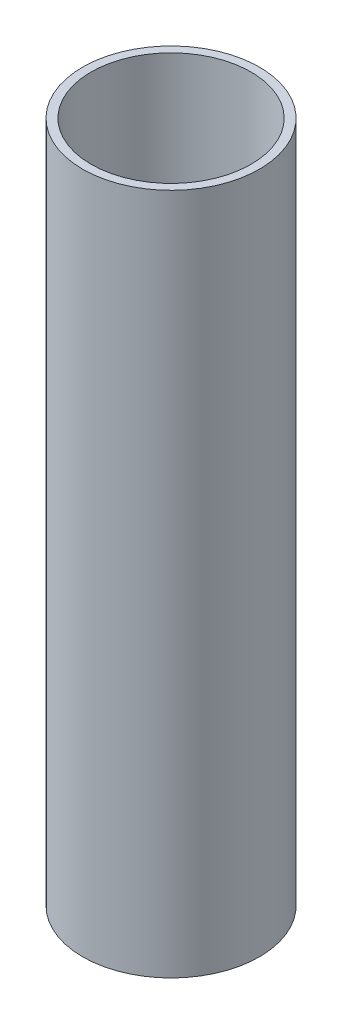
ISO-10303-21;
HEADER;
FILE_DESCRIPTION(('STEP AP214'),'2;1');
FILE_NAME('part.step','',(''),(''),'','','');
FILE_SCHEMA(('AUTOMOTIVE_DESIGN { 1 0 10303 214 1 1 1 1 }'));
ENDSEC;
DATA;
#1=APPLICATION_CONTEXT('core data for automotive mechanical design processes');
#2=APPLICATION_PROTOCOL_DEFINITION('international standard','automotive_design',2000,#1);
#3=PRODUCT_CONTEXT('',#1,'mechanical');
#4=PRODUCT('Part','Part','',(#3));
#5=PRODUCT_RELATED_PRODUCT_CATEGORY('part','',(#4));
#6=PRODUCT_DEFINITION_FORMATION('','',#4);
#7=PRODUCT_DEFINITION_CONTEXT('part definition',#1,'design');
#8=PRODUCT_DEFINITION('design','',#6,#7);
#9=PRODUCT_DEFINITION_SHAPE('','',#8);
#10=(LENGTH_UNIT() NAMED_UNIT(*) SI_UNIT(.MILLI.,.METRE.));
#11=(NAMED_UNIT(*) PLANE_ANGLE_UNIT() SI_UNIT($,.RADIAN.));
#12=(NAMED_UNIT(*) SI_UNIT($,.STERADIAN.) SOLID_ANGLE_UNIT());
#13=UNCERTAINTY_MEASURE_WITH_UNIT(LENGTH_MEASURE(1.E-05),#10,'distance_accuracy_value','');
#14=(GEOMETRIC_REPRESENTATION_CONTEXT(3) GLOBAL_UNCERTAINTY_ASSIGNED_CONTEXT((#13)) GLOBAL_UNIT_ASSIGNED_CONTEXT((#10,
#11,#12)) REPRESENTATION_CONTEXT('',''));
#15=CARTESIAN_POINT('',(0.,0.,0.));
#16=DIRECTION('',(0.,0.,1.));
#17=DIRECTION('',(1.,0.,0.));
#18=AXIS2_PLACEMENT_3D('',#15,#16,#17);
#19=CARTESIAN_POINT('',(0.,162.,0.));
#20=DIRECTION('',(0.,1.,0.));
#21=DIRECTION('',(0.,0.,1.));
#22=AXIS2_PLACEMENT_3D('',#19,#20,#21);
#23=PLANE('',#22);
#24=CARTESIAN_POINT('',(0.,162.,0.));
#25=DIRECTION('',(0.,1.,0.));
#26=DIRECTION('',(0.,0.,1.));
#27=AXIS2_PLACEMENT_3D('',#24,#25,#26);
#28=CIRCLE('',#27,21.);
#29=CARTESIAN_POINT('',(0.,162.,21.));
#30=VERTEX_POINT('',#29);
#31=EDGE_CURVE('E10',#30,#30,#28,.T.);
#32=ORIENTED_EDGE('',*,*,#31,.T.);
#33=EDGE_LOOP('',(#32));
#34=FACE_BOUND('',#33,.T.);
#35=CARTESIAN_POINT('',(0.,162.,0.));
#36=DIRECTION('',(0.,1.,0.));
#37=DIRECTION('',(0.,0.,1.));
#38=AXIS2_PLACEMENT_3D('',#35,#36,#37);
#39=CIRCLE('',#38,19.);
#40=CARTESIAN_POINT('',(0.,162.,19.));
#41=VERTEX_POINT('',#40);
#42=EDGE_CURVE('E50',#41,#41,#39,.T.);
#43=ORIENTED_EDGE('',*,*,#42,.F.);
#44=EDGE_LOOP('',(#43));
#45=FACE_BOUND('',#44,.T.);
#46=ADVANCED_FACE('F37',(#34,#45),#23,.T.);
#47=CARTESIAN_POINT('',(0.,0.,0.));
#48=DIRECTION('',(0.,1.,0.));
#49=DIRECTION('',(0.,0.,1.));
#50=AXIS2_PLACEMENT_3D('',#47,#48,#49);
#51=PLANE('',#50);
#52=CARTESIAN_POINT('',(0.,0.,0.));
#53=DIRECTION('',(0.,1.,0.));
#54=DIRECTION('',(0.,0.,1.));
#55=AXIS2_PLACEMENT_3D('',#52,#53,#54);
#56=CIRCLE('',#55,21.);
#57=CARTESIAN_POINT('',(0.,0.,21.));
#58=VERTEX_POINT('',#57);
#59=EDGE_CURVE('E41',#58,#58,#56,.T.);
#60=ORIENTED_EDGE('',*,*,#59,.F.);
#61=EDGE_LOOP('',(#60));
#62=FACE_BOUND('',#61,.T.);
#63=CARTESIAN_POINT('',(0.,0.,0.));
#64=DIRECTION('',(0.,1.,0.));
#65=DIRECTION('',(0.,0.,1.));
#66=AXIS2_PLACEMENT_3D('',#63,#64,#65);
#67=CIRCLE('',#66,19.);
#68=CARTESIAN_POINT('',(0.,0.,19.));
#69=VERTEX_POINT('',#68);
#70=EDGE_CURVE('E52',#69,#69,#67,.T.);
#71=ORIENTED_EDGE('',*,*,#70,.T.);
#72=EDGE_LOOP('',(#71));
#73=FACE_BOUND('',#72,.T.);
#74=ADVANCED_FACE('F64',(#62,#73),#51,.F.);
#75=CARTESIAN_POINT('',(0.,162.,0.));
#76=DIRECTION('',(0.,-1.,0.));
#77=DIRECTION('',(0.,0.,-1.));
#78=AXIS2_PLACEMENT_3D('',#75,#76,#77);
#79=CYLINDRICAL_SURFACE('',#78,21.);
#80=ORIENTED_EDGE('',*,*,#31,.F.);
#81=EDGE_LOOP('',(#80));
#82=FACE_BOUND('',#81,.T.);
#83=ORIENTED_EDGE('',*,*,#59,.T.);
#84=EDGE_LOOP('',(#83));
#85=FACE_BOUND('',#84,.T.);
#86=ADVANCED_FACE('F39',(#82,#85),#79,.T.);
#87=CARTESIAN_POINT('',(0.,162.,0.));
#88=DIRECTION('',(0.,-1.,0.));
#89=DIRECTION('',(0.,0.,-1.));
#90=AXIS2_PLACEMENT_3D('',#87,#88,#89);
#91=CYLINDRICAL_SURFACE('',#90,19.);
#92=ORIENTED_EDGE('',*,*,#42,.T.);
#93=EDGE_LOOP('',(#92));
#94=FACE_BOUND('',#93,.T.);
#95=ORIENTED_EDGE('',*,*,#70,.F.);
#96=EDGE_LOOP('',(#95));
#97=FACE_BOUND('',#96,.T.);
#98=ADVANCED_FACE('F60',(#94,#97),#91,.F.);
#99=CLOSED_SHELL('',(#46,#74,#86,#98));
#100=MANIFOLD_SOLID_BREP('B2',#99);
#101=ADVANCED_BREP_SHAPE_REPRESENTATION('',(#18,#100),#14);
#102=SHAPE_DEFINITION_REPRESENTATION(#9,#101);
ENDSEC;
END-ISO-10303-21;
